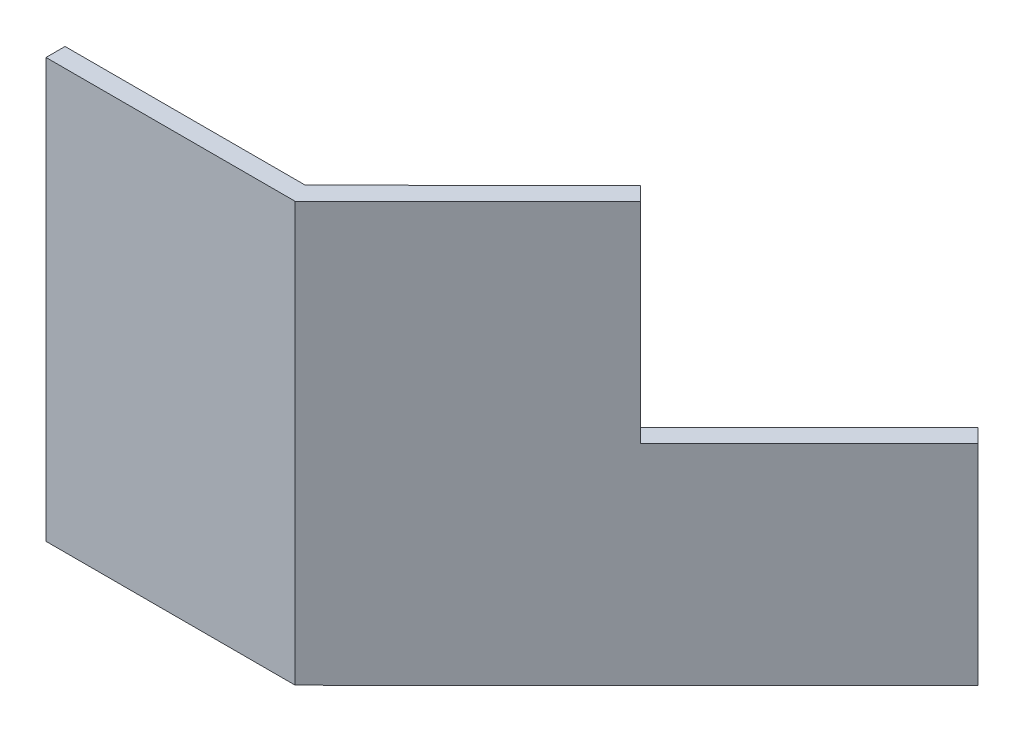
ISO-10303-21;
HEADER;
FILE_DESCRIPTION(('STEP AP214'),'2;1');
FILE_NAME('part.step','',(''),(''),'','','');
FILE_SCHEMA(('AUTOMOTIVE_DESIGN { 1 0 10303 214 1 1 1 1 }'));
ENDSEC;
DATA;
#1=APPLICATION_CONTEXT('core data for automotive mechanical design processes');
#2=APPLICATION_PROTOCOL_DEFINITION('international standard','automotive_design',2000,#1);
#3=PRODUCT_CONTEXT('',#1,'mechanical');
#4=PRODUCT('Part','Part','',(#3));
#5=PRODUCT_RELATED_PRODUCT_CATEGORY('part','',(#4));
#6=PRODUCT_DEFINITION_FORMATION('','',#4);
#7=PRODUCT_DEFINITION_CONTEXT('part definition',#1,'design');
#8=PRODUCT_DEFINITION('design','',#6,#7);
#9=PRODUCT_DEFINITION_SHAPE('','',#8);
#10=(LENGTH_UNIT() NAMED_UNIT(*) SI_UNIT(.MILLI.,.METRE.));
#11=(NAMED_UNIT(*) PLANE_ANGLE_UNIT() SI_UNIT($,.RADIAN.));
#12=(NAMED_UNIT(*) SI_UNIT($,.STERADIAN.) SOLID_ANGLE_UNIT());
#13=UNCERTAINTY_MEASURE_WITH_UNIT(LENGTH_MEASURE(1.E-05),#10,'distance_accuracy_value','');
#14=(GEOMETRIC_REPRESENTATION_CONTEXT(3) GLOBAL_UNCERTAINTY_ASSIGNED_CONTEXT((#13)) GLOBAL_UNIT_ASSIGNED_CONTEXT((#10,
#11,#12)) REPRESENTATION_CONTEXT('',''));
#15=CARTESIAN_POINT('',(0.,0.,0.));
#16=DIRECTION('',(0.,0.,1.));
#17=DIRECTION('',(1.,0.,0.));
#18=AXIS2_PLACEMENT_3D('',#15,#16,#17);
#19=CARTESIAN_POINT('',(-0.253590847890702,7.62,0.));
#20=DIRECTION('',(-0.706536576381891,0.,-0.707676526553309));
#21=DIRECTION('',(-0.707676526553309,0.,0.706536576381891));
#22=AXIS2_PLACEMENT_3D('',#19,#20,#21);
#23=PLANE('',#22);
#24=DIRECTION('',(0.,1.,0.));
#25=VECTOR('',#24,1.);
#26=CARTESIAN_POINT('',(2.7937679254697,3.81,-3.0424499809592));
#27=LINE('',#26,#25);
#28=CARTESIAN_POINT('',(2.7937679254697,3.81,-3.0424499809592));
#29=VERTEX_POINT('',#28);
#30=CARTESIAN_POINT('',(2.7937679254697,7.62,-3.04244998095919));
#31=VERTEX_POINT('',#30);
#32=EDGE_CURVE('E52',#29,#31,#27,.T.);
#33=ORIENTED_EDGE('',*,*,#32,.F.);
#34=DIRECTION('',(-0.70767652655331,0.,0.70653657638189));
#35=VECTOR('',#34,1.);
#36=CARTESIAN_POINT('',(5.86619508961806,3.81,-6.10992797166315));
#37=LINE('',#36,#35);
#38=CARTESIAN_POINT('',(5.86619508961806,3.81,-6.10992797166315));
#39=VERTEX_POINT('',#38);
#40=EDGE_CURVE('E126',#39,#29,#37,.T.);
#41=ORIENTED_EDGE('',*,*,#40,.F.);
#42=DIRECTION('',(0.,-1.,0.));
#43=VECTOR('',#42,1.);
#44=CARTESIAN_POINT('',(5.86619508961806,7.62,-6.10992797166315));
#45=LINE('',#44,#43);
#46=CARTESIAN_POINT('',(5.86619508961806,0.,-6.10992797166315));
#47=VERTEX_POINT('',#46);
#48=EDGE_CURVE('E39',#39,#47,#45,.T.);
#49=ORIENTED_EDGE('',*,*,#48,.T.);
#50=DIRECTION('',(0.707676526553309,0.,-0.706536576381891));
#51=VECTOR('',#50,1.);
#52=CARTESIAN_POINT('',(-0.253590847890702,0.,0.));
#53=LINE('',#52,#51);
#54=CARTESIAN_POINT('',(-0.253590847890702,0.,0.));
#55=VERTEX_POINT('',#54);
#56=EDGE_CURVE('E151',#55,#47,#53,.T.);
#57=ORIENTED_EDGE('',*,*,#56,.F.);
#58=DIRECTION('',(0.,-1.,0.));
#59=VECTOR('',#58,1.);
#60=CARTESIAN_POINT('',(-0.253590847890702,7.62,0.));
#61=LINE('',#60,#59);
#62=CARTESIAN_POINT('',(-0.253590847890702,7.62,0.));
#63=VERTEX_POINT('',#62);
#64=EDGE_CURVE('E11',#63,#55,#61,.T.);
#65=ORIENTED_EDGE('',*,*,#64,.F.);
#66=DIRECTION('',(0.707676526553309,0.,-0.706536576381891));
#67=VECTOR('',#66,1.);
#68=CARTESIAN_POINT('',(-0.253590847890702,7.62,0.));
#69=LINE('',#68,#67);
#70=EDGE_CURVE('E141',#63,#31,#69,.T.);
#71=ORIENTED_EDGE('',*,*,#70,.T.);
#72=EDGE_LOOP('',(#33,#41,#49,#57,#65,#71));
#73=FACE_BOUND('',#72,.T.);
#74=ADVANCED_FACE('F36',(#73),#23,.T.);
#75=CARTESIAN_POINT('',(-0.253590847890702,7.62,0.));
#76=DIRECTION('',(0.,0.,1.));
#77=DIRECTION('',(1.,0.,0.));
#78=AXIS2_PLACEMENT_3D('',#75,#76,#77);
#79=PLANE('',#78);
#80=DIRECTION('',(-1.,0.,0.));
#81=VECTOR('',#80,1.);
#82=CARTESIAN_POINT('',(-0.253590847890702,0.,0.));
#83=LINE('',#82,#81);
#84=CARTESIAN_POINT('',(-4.62341997626936,0.,0.));
#85=VERTEX_POINT('',#84);
#86=EDGE_CURVE('E139',#55,#85,#83,.T.);
#87=ORIENTED_EDGE('',*,*,#86,.T.);
#88=DIRECTION('',(0.,-1.,0.));
#89=VECTOR('',#88,1.);
#90=CARTESIAN_POINT('',(-4.62341997626936,7.62,0.));
#91=LINE('',#90,#89);
#92=CARTESIAN_POINT('',(-4.62341997626936,7.62,0.));
#93=VERTEX_POINT('',#92);
#94=EDGE_CURVE('E44',#93,#85,#91,.T.);
#95=ORIENTED_EDGE('',*,*,#94,.F.);
#96=DIRECTION('',(-1.,0.,0.));
#97=VECTOR('',#96,1.);
#98=CARTESIAN_POINT('',(-0.253590847890702,7.62,0.));
#99=LINE('',#98,#97);
#100=EDGE_CURVE('E134',#63,#93,#99,.T.);
#101=ORIENTED_EDGE('',*,*,#100,.F.);
#102=ORIENTED_EDGE('',*,*,#64,.T.);
#103=EDGE_LOOP('',(#87,#95,#101,#102));
#104=FACE_BOUND('',#103,.T.);
#105=ADVANCED_FACE('F182',(#104),#79,.F.);
#106=CARTESIAN_POINT('',(-4.62341997626936,7.62,0.));
#107=DIRECTION('',(1.,0.,0.));
#108=DIRECTION('',(0.,0.,-1.));
#109=AXIS2_PLACEMENT_3D('',#106,#107,#108);
#110=PLANE('',#109);
#111=DIRECTION('',(0.,0.,1.));
#112=VECTOR('',#111,1.);
#113=CARTESIAN_POINT('',(-4.62341997626936,0.,0.));
#114=LINE('',#113,#112);
#115=CARTESIAN_POINT('',(-4.62341997626936,0.,0.346366729309766));
#116=VERTEX_POINT('',#115);
#117=EDGE_CURVE('E142',#85,#116,#114,.T.);
#118=ORIENTED_EDGE('',*,*,#117,.T.);
#119=DIRECTION('',(0.,-1.,0.));
#120=VECTOR('',#119,1.);
#121=CARTESIAN_POINT('',(-4.62341997626936,7.62,0.346366729309766));
#122=LINE('',#121,#120);
#123=CARTESIAN_POINT('',(-4.62341997626936,7.62,0.346366729309766));
#124=VERTEX_POINT('',#123);
#125=EDGE_CURVE('E132',#124,#116,#122,.T.);
#126=ORIENTED_EDGE('',*,*,#125,.F.);
#127=DIRECTION('',(0.,0.,1.));
#128=VECTOR('',#127,1.);
#129=CARTESIAN_POINT('',(-4.62341997626936,7.62,0.));
#130=LINE('',#129,#128);
#131=EDGE_CURVE('E156',#93,#124,#130,.T.);
#132=ORIENTED_EDGE('',*,*,#131,.F.);
#133=ORIENTED_EDGE('',*,*,#94,.T.);
#134=EDGE_LOOP('',(#118,#126,#132,#133));
#135=FACE_BOUND('',#134,.T.);
#136=ADVANCED_FACE('F179',(#135),#110,.F.);
#137=CARTESIAN_POINT('',(-0.0925157569361188,7.62,0.346366729309766));
#138=DIRECTION('',(0.,0.,1.));
#139=DIRECTION('',(1.,0.,0.));
#140=AXIS2_PLACEMENT_3D('',#137,#138,#139);
#141=PLANE('',#140);
#142=DIRECTION('',(-1.,0.,0.));
#143=VECTOR('',#142,1.);
#144=CARTESIAN_POINT('',(-0.0925157569361188,0.,0.346366729309766));
#145=LINE('',#144,#143);
#146=CARTESIAN_POINT('',(-0.0925157569361188,0.,0.346366729309766));
#147=VERTEX_POINT('',#146);
#148=EDGE_CURVE('E145',#147,#116,#145,.T.);
#149=ORIENTED_EDGE('',*,*,#148,.F.);
#150=DIRECTION('',(0.,-1.,0.));
#151=VECTOR('',#150,1.);
#152=CARTESIAN_POINT('',(-0.0925157569361188,7.62,0.346366729309766));
#153=LINE('',#152,#151);
#154=CARTESIAN_POINT('',(-0.0925157569361188,7.62,0.346366729309766));
#155=VERTEX_POINT('',#154);
#156=EDGE_CURVE('E90',#155,#147,#153,.T.);
#157=ORIENTED_EDGE('',*,*,#156,.F.);
#158=DIRECTION('',(-1.,0.,0.));
#159=VECTOR('',#158,1.);
#160=CARTESIAN_POINT('',(-0.0925157569361188,7.62,0.346366729309766));
#161=LINE('',#160,#159);
#162=EDGE_CURVE('E158',#155,#124,#161,.T.);
#163=ORIENTED_EDGE('',*,*,#162,.T.);
#164=ORIENTED_EDGE('',*,*,#125,.T.);
#165=EDGE_LOOP('',(#149,#157,#163,#164));
#166=FACE_BOUND('',#165,.T.);
#167=ADVANCED_FACE('F176',(#166),#141,.T.);
#168=CARTESIAN_POINT('',(-0.0925157569361188,7.62,0.346366729309766));
#169=DIRECTION('',(-0.706536576381891,0.,-0.707676526553309));
#170=DIRECTION('',(-0.707676526553309,0.,0.706536576381891));
#171=AXIS2_PLACEMENT_3D('',#168,#169,#170);
#172=PLANE('',#171);
#173=DIRECTION('',(0.70767652655331,0.,-0.70653657638189));
#174=VECTOR('',#173,1.);
#175=CARTESIAN_POINT('',(6.11978593750876,3.81,-5.85592797166315));
#176=LINE('',#175,#174);
#177=CARTESIAN_POINT('',(3.0473587733604,3.81,-2.7884499809592));
#178=VERTEX_POINT('',#177);
#179=CARTESIAN_POINT('',(6.11978593750876,3.81,-5.85592797166315));
#180=VERTEX_POINT('',#179);
#181=EDGE_CURVE('E109',#178,#180,#176,.T.);
#182=ORIENTED_EDGE('',*,*,#181,.F.);
#183=DIRECTION('',(0.,1.,0.));
#184=VECTOR('',#183,1.);
#185=CARTESIAN_POINT('',(3.0473587733604,3.81,-2.7884499809592));
#186=LINE('',#185,#184);
#187=CARTESIAN_POINT('',(3.0473587733604,7.62,-2.7884499809592));
#188=VERTEX_POINT('',#187);
#189=EDGE_CURVE('E154',#178,#188,#186,.T.);
#190=ORIENTED_EDGE('',*,*,#189,.T.);
#191=DIRECTION('',(0.707676526553309,0.,-0.706536576381891));
#192=VECTOR('',#191,1.);
#193=CARTESIAN_POINT('',(-0.0925157569361188,7.62,0.346366729309766));
#194=LINE('',#193,#192);
#195=EDGE_CURVE('E160',#155,#188,#194,.T.);
#196=ORIENTED_EDGE('',*,*,#195,.F.);
#197=ORIENTED_EDGE('',*,*,#156,.T.);
#198=DIRECTION('',(0.707676526553309,0.,-0.706536576381891));
#199=VECTOR('',#198,1.);
#200=CARTESIAN_POINT('',(-0.0925157569361188,0.,0.346366729309766));
#201=LINE('',#200,#199);
#202=CARTESIAN_POINT('',(6.11978593750876,0.,-5.85592797166315));
#203=VERTEX_POINT('',#202);
#204=EDGE_CURVE('E130',#147,#203,#201,.T.);
#205=ORIENTED_EDGE('',*,*,#204,.T.);
#206=DIRECTION('',(0.,-1.,0.));
#207=VECTOR('',#206,1.);
#208=CARTESIAN_POINT('',(6.11978593750876,7.62,-5.85592797166315));
#209=LINE('',#208,#207);
#210=EDGE_CURVE('E124',#180,#203,#209,.T.);
#211=ORIENTED_EDGE('',*,*,#210,.F.);
#212=EDGE_LOOP('',(#182,#190,#196,#197,#205,#211));
#213=FACE_BOUND('',#212,.T.);
#214=ADVANCED_FACE('F128',(#213),#172,.F.);
#215=CARTESIAN_POINT('',(6.11978593750876,7.62,-5.85592797166315));
#216=DIRECTION('',(-0.70767652655331,0.,0.70653657638189));
#217=DIRECTION('',(0.70653657638189,0.,0.70767652655331));
#218=AXIS2_PLACEMENT_3D('',#215,#216,#217);
#219=PLANE('',#218);
#220=ORIENTED_EDGE('',*,*,#48,.F.);
#221=DIRECTION('',(-0.70653657638189,0.,-0.70767652655331));
#222=VECTOR('',#221,1.);
#223=CARTESIAN_POINT('',(6.11978593750876,3.81,-5.85592797166315));
#224=LINE('',#223,#222);
#225=EDGE_CURVE('E112',#180,#39,#224,.T.);
#226=ORIENTED_EDGE('',*,*,#225,.F.);
#227=ORIENTED_EDGE('',*,*,#210,.T.);
#228=DIRECTION('',(-0.70653657638189,0.,-0.70767652655331));
#229=VECTOR('',#228,1.);
#230=CARTESIAN_POINT('',(6.11978593750876,0.,-5.85592797166315));
#231=LINE('',#230,#229);
#232=EDGE_CURVE('E149',#203,#47,#231,.T.);
#233=ORIENTED_EDGE('',*,*,#232,.T.);
#234=EDGE_LOOP('',(#220,#226,#227,#233));
#235=FACE_BOUND('',#234,.T.);
#236=ADVANCED_FACE('F122',(#235),#219,.F.);
#237=CARTESIAN_POINT('',(0.,7.62,0.));
#238=DIRECTION('',(0.,1.,0.));
#239=DIRECTION('',(0.,0.,1.));
#240=AXIS2_PLACEMENT_3D('',#237,#238,#239);
#241=PLANE('',#240);
#242=DIRECTION('',(0.70653657638189,0.,0.70767652655331));
#243=VECTOR('',#242,1.);
#244=CARTESIAN_POINT('',(3.0473587733604,7.62,-2.7884499809592));
#245=LINE('',#244,#243);
#246=EDGE_CURVE('E118',#31,#188,#245,.T.);
#247=ORIENTED_EDGE('',*,*,#246,.F.);
#248=ORIENTED_EDGE('',*,*,#70,.F.);
#249=ORIENTED_EDGE('',*,*,#100,.T.);
#250=ORIENTED_EDGE('',*,*,#131,.T.);
#251=ORIENTED_EDGE('',*,*,#162,.F.);
#252=ORIENTED_EDGE('',*,*,#195,.T.);
#253=EDGE_LOOP('',(#247,#248,#249,#250,#251,#252));
#254=FACE_BOUND('',#253,.T.);
#255=ADVANCED_FACE('F171',(#254),#241,.T.);
#256=CARTESIAN_POINT('',(0.,0.,0.));
#257=DIRECTION('',(0.,1.,0.));
#258=DIRECTION('',(0.,0.,1.));
#259=AXIS2_PLACEMENT_3D('',#256,#257,#258);
#260=PLANE('',#259);
#261=ORIENTED_EDGE('',*,*,#56,.T.);
#262=ORIENTED_EDGE('',*,*,#232,.F.);
#263=ORIENTED_EDGE('',*,*,#204,.F.);
#264=ORIENTED_EDGE('',*,*,#148,.T.);
#265=ORIENTED_EDGE('',*,*,#117,.F.);
#266=ORIENTED_EDGE('',*,*,#86,.F.);
#267=EDGE_LOOP('',(#261,#262,#263,#264,#265,#266));
#268=FACE_BOUND('',#267,.T.);
#269=ADVANCED_FACE('F181',(#268),#260,.F.);
#270=CARTESIAN_POINT('',(3.0473587733604,3.81,-2.7884499809592));
#271=DIRECTION('',(-0.70767652655331,0.,0.70653657638189));
#272=DIRECTION('',(0.70653657638189,0.,0.70767652655331));
#273=AXIS2_PLACEMENT_3D('',#270,#271,#272);
#274=PLANE('',#273);
#275=ORIENTED_EDGE('',*,*,#246,.T.);
#276=ORIENTED_EDGE('',*,*,#189,.F.);
#277=DIRECTION('',(0.70653657638189,0.,0.70767652655331));
#278=VECTOR('',#277,1.);
#279=CARTESIAN_POINT('',(3.0473587733604,3.81,-2.7884499809592));
#280=LINE('',#279,#278);
#281=EDGE_CURVE('E114',#29,#178,#280,.T.);
#282=ORIENTED_EDGE('',*,*,#281,.F.);
#283=ORIENTED_EDGE('',*,*,#32,.T.);
#284=EDGE_LOOP('',(#275,#276,#282,#283));
#285=FACE_BOUND('',#284,.T.);
#286=ADVANCED_FACE('F168',(#285),#274,.F.);
#287=CARTESIAN_POINT('',(0.,3.81,0.));
#288=DIRECTION('',(0.,-1.,0.));
#289=DIRECTION('',(0.,0.,-1.));
#290=AXIS2_PLACEMENT_3D('',#287,#288,#289);
#291=PLANE('',#290);
#292=ORIENTED_EDGE('',*,*,#181,.T.);
#293=ORIENTED_EDGE('',*,*,#225,.T.);
#294=ORIENTED_EDGE('',*,*,#40,.T.);
#295=ORIENTED_EDGE('',*,*,#281,.T.);
#296=EDGE_LOOP('',(#292,#293,#294,#295));
#297=FACE_BOUND('',#296,.T.);
#298=ADVANCED_FACE('F111',(#297),#291,.F.);
#299=CLOSED_SHELL('',(#74,#105,#136,#167,#214,#236,#255,#269,#286,#298));
#300=MANIFOLD_SOLID_BREP('B2',#299);
#301=ADVANCED_BREP_SHAPE_REPRESENTATION('',(#18,#300),#14);
#302=SHAPE_DEFINITION_REPRESENTATION(#9,#301);
ENDSEC;
END-ISO-10303-21;
